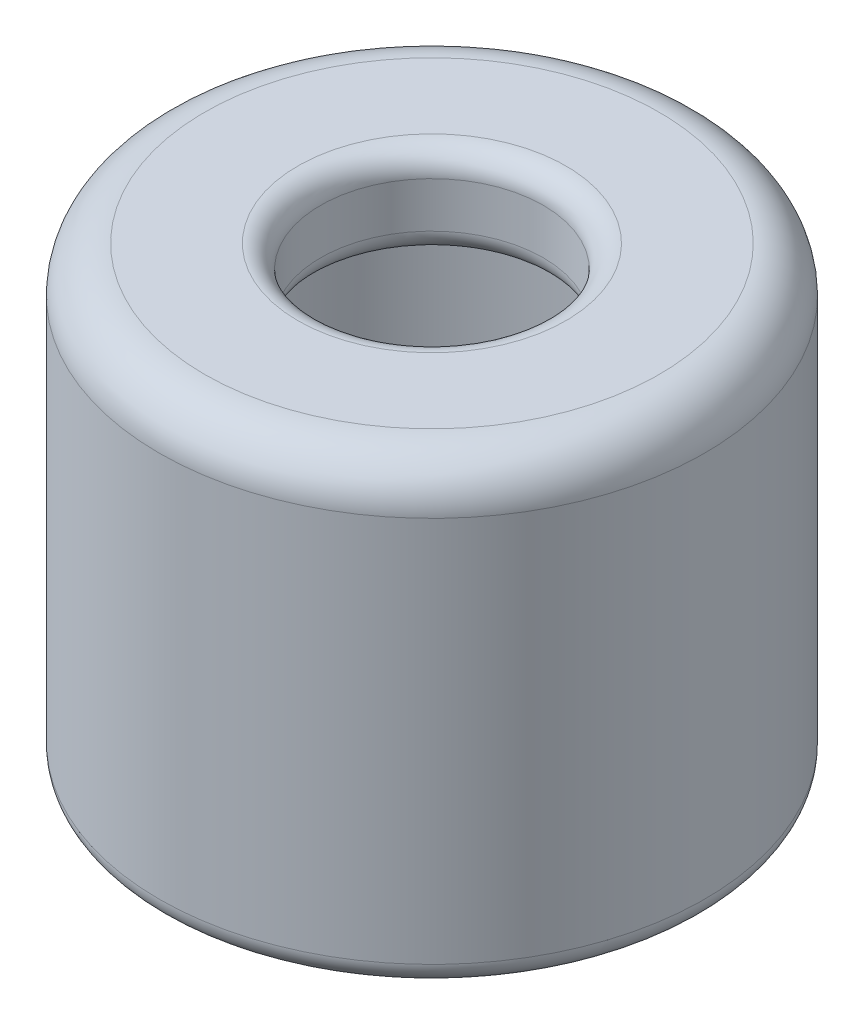
ISO-10303-21;
HEADER;
FILE_DESCRIPTION(('STEP AP214'),'2;1');
FILE_NAME('part.step','',(''),(''),'','','');
FILE_SCHEMA(('AUTOMOTIVE_DESIGN { 1 0 10303 214 1 1 1 1 }'));
ENDSEC;
DATA;
#1=APPLICATION_CONTEXT('core data for automotive mechanical design processes');
#2=APPLICATION_PROTOCOL_DEFINITION('international standard','automotive_design',2000,#1);
#3=PRODUCT_CONTEXT('',#1,'mechanical');
#4=PRODUCT('Part','Part','',(#3));
#5=PRODUCT_RELATED_PRODUCT_CATEGORY('part','',(#4));
#6=PRODUCT_DEFINITION_FORMATION('','',#4);
#7=PRODUCT_DEFINITION_CONTEXT('part definition',#1,'design');
#8=PRODUCT_DEFINITION('design','',#6,#7);
#9=PRODUCT_DEFINITION_SHAPE('','',#8);
#10=(LENGTH_UNIT() NAMED_UNIT(*) SI_UNIT(.MILLI.,.METRE.));
#11=(NAMED_UNIT(*) PLANE_ANGLE_UNIT() SI_UNIT($,.RADIAN.));
#12=(NAMED_UNIT(*) SI_UNIT($,.STERADIAN.) SOLID_ANGLE_UNIT());
#13=UNCERTAINTY_MEASURE_WITH_UNIT(LENGTH_MEASURE(1.E-05),#10,'distance_accuracy_value','');
#14=(GEOMETRIC_REPRESENTATION_CONTEXT(3) GLOBAL_UNCERTAINTY_ASSIGNED_CONTEXT((#13)) GLOBAL_UNIT_ASSIGNED_CONTEXT((#10,
#11,#12)) REPRESENTATION_CONTEXT('',''));
#15=CARTESIAN_POINT('',(0.,0.,0.));
#16=DIRECTION('',(0.,0.,1.));
#17=DIRECTION('',(1.,0.,0.));
#18=AXIS2_PLACEMENT_3D('',#15,#16,#17);
#19=CARTESIAN_POINT('',(0.,10.,0.));
#20=DIRECTION('',(0.,-1.,0.));
#21=DIRECTION('',(0.,0.,-1.));
#22=AXIS2_PLACEMENT_3D('',#19,#20,#21);
#23=CYLINDRICAL_SURFACE('',#22,2.45);
#24=CARTESIAN_POINT('',(0.,8.5,0.));
#25=DIRECTION('',(0.,-1.,0.));
#26=DIRECTION('',(0.,0.,-1.));
#27=AXIS2_PLACEMENT_3D('',#24,#25,#26);
#28=CIRCLE('',#27,2.45);
#29=CARTESIAN_POINT('',(0.,8.5,-2.45));
#30=VERTEX_POINT('',#29);
#31=EDGE_CURVE('E50',#30,#30,#28,.T.);
#32=ORIENTED_EDGE('',*,*,#31,.T.);
#33=EDGE_LOOP('',(#32));
#34=FACE_BOUND('',#33,.T.);
#35=CARTESIAN_POINT('',(0.,9.5,0.));
#36=DIRECTION('',(0.,1.,0.));
#37=DIRECTION('',(0.,0.,1.));
#38=AXIS2_PLACEMENT_3D('',#35,#36,#37);
#39=CIRCLE('',#38,2.45);
#40=CARTESIAN_POINT('',(0.,9.5,2.45));
#41=VERTEX_POINT('',#40);
#42=EDGE_CURVE('E55',#41,#41,#39,.T.);
#43=ORIENTED_EDGE('',*,*,#42,.T.);
#44=EDGE_LOOP('',(#43));
#45=FACE_BOUND('',#44,.T.);
#46=ADVANCED_FACE('F35',(#34,#45),#23,.F.);
#47=CARTESIAN_POINT('',(0.,10.,0.));
#48=DIRECTION('',(0.,1.,0.));
#49=DIRECTION('',(0.,0.,1.));
#50=AXIS2_PLACEMENT_3D('',#47,#48,#49);
#51=PLANE('',#50);
#52=CARTESIAN_POINT('',(0.,10.,0.));
#53=DIRECTION('',(0.,1.,0.));
#54=DIRECTION('',(0.,0.,1.));
#55=AXIS2_PLACEMENT_3D('',#52,#53,#54);
#56=CIRCLE('',#55,2.95);
#57=CARTESIAN_POINT('',(0.,10.,2.95));
#58=VERTEX_POINT('',#57);
#59=EDGE_CURVE('E10',#58,#58,#56,.F.);
#60=ORIENTED_EDGE('',*,*,#59,.T.);
#61=EDGE_LOOP('',(#60));
#62=FACE_BOUND('',#61,.T.);
#63=CARTESIAN_POINT('',(0.,10.,0.));
#64=DIRECTION('',(0.,1.,0.));
#65=DIRECTION('',(0.,0.,1.));
#66=AXIS2_PLACEMENT_3D('',#63,#64,#65);
#67=CIRCLE('',#66,5.);
#68=CARTESIAN_POINT('',(0.,10.,5.));
#69=VERTEX_POINT('',#68);
#70=EDGE_CURVE('E76',#69,#69,#67,.T.);
#71=ORIENTED_EDGE('',*,*,#70,.T.);
#72=EDGE_LOOP('',(#71));
#73=FACE_BOUND('',#72,.T.);
#74=ADVANCED_FACE('F80',(#62,#73),#51,.T.);
#75=CARTESIAN_POINT('',(0.,0.,0.));
#76=DIRECTION('',(0.,1.,0.));
#77=DIRECTION('',(0.,0.,1.));
#78=AXIS2_PLACEMENT_3D('',#75,#76,#77);
#79=PLANE('',#78);
#80=CARTESIAN_POINT('',(0.,0.,0.));
#81=DIRECTION('',(0.,1.,0.));
#82=DIRECTION('',(0.,0.,1.));
#83=AXIS2_PLACEMENT_3D('',#80,#81,#82);
#84=CIRCLE('',#83,5.5);
#85=CARTESIAN_POINT('',(0.,0.,5.5));
#86=VERTEX_POINT('',#85);
#87=EDGE_CURVE('E64',#86,#86,#84,.F.);
#88=ORIENTED_EDGE('',*,*,#87,.T.);
#89=EDGE_LOOP('',(#88));
#90=FACE_BOUND('',#89,.T.);
#91=CARTESIAN_POINT('',(0.,0.,0.));
#92=DIRECTION('',(0.,1.,0.));
#93=DIRECTION('',(0.,0.,1.));
#94=AXIS2_PLACEMENT_3D('',#91,#92,#93);
#95=CIRCLE('',#94,5.);
#96=CARTESIAN_POINT('',(0.,0.,5.));
#97=VERTEX_POINT('',#96);
#98=EDGE_CURVE('E67',#97,#97,#95,.T.);
#99=ORIENTED_EDGE('',*,*,#98,.T.);
#100=EDGE_LOOP('',(#99));
#101=FACE_BOUND('',#100,.T.);
#102=ADVANCED_FACE('F105',(#90,#101),#79,.F.);
#103=CARTESIAN_POINT('',(0.,10.,0.));
#104=DIRECTION('',(0.,-1.,0.));
#105=DIRECTION('',(0.,0.,-1.));
#106=AXIS2_PLACEMENT_3D('',#103,#104,#105);
#107=CYLINDRICAL_SURFACE('',#106,6.);
#108=CARTESIAN_POINT('',(0.,0.5,0.));
#109=DIRECTION('',(0.,1.,0.));
#110=DIRECTION('',(0.,0.,1.));
#111=AXIS2_PLACEMENT_3D('',#108,#109,#110);
#112=CIRCLE('',#111,6.);
#113=CARTESIAN_POINT('',(0.,0.5,6.));
#114=VERTEX_POINT('',#113);
#115=EDGE_CURVE('E70',#114,#114,#112,.T.);
#116=ORIENTED_EDGE('',*,*,#115,.T.);
#117=EDGE_LOOP('',(#116));
#118=FACE_BOUND('',#117,.T.);
#119=CARTESIAN_POINT('',(0.,9.,0.));
#120=DIRECTION('',(0.,1.,0.));
#121=DIRECTION('',(0.,0.,1.));
#122=AXIS2_PLACEMENT_3D('',#119,#120,#121);
#123=CIRCLE('',#122,6.);
#124=CARTESIAN_POINT('',(0.,9.,6.));
#125=VERTEX_POINT('',#124);
#126=EDGE_CURVE('E73',#125,#125,#123,.F.);
#127=ORIENTED_EDGE('',*,*,#126,.T.);
#128=EDGE_LOOP('',(#127));
#129=FACE_BOUND('',#128,.T.);
#130=ADVANCED_FACE('F111',(#118,#129),#107,.T.);
#131=CARTESIAN_POINT('',(0.,8.,0.));
#132=DIRECTION('',(0.,-1.,0.));
#133=DIRECTION('',(0.,0.,-1.));
#134=AXIS2_PLACEMENT_3D('',#131,#132,#133);
#135=CYLINDRICAL_SURFACE('',#134,4.5);
#136=CARTESIAN_POINT('',(0.,0.5,0.));
#137=DIRECTION('',(0.,1.,0.));
#138=DIRECTION('',(0.,0.,1.));
#139=AXIS2_PLACEMENT_3D('',#136,#137,#138);
#140=CIRCLE('',#139,4.5);
#141=CARTESIAN_POINT('',(0.,0.5,4.5));
#142=VERTEX_POINT('',#141);
#143=EDGE_CURVE('E58',#142,#142,#140,.F.);
#144=ORIENTED_EDGE('',*,*,#143,.T.);
#145=EDGE_LOOP('',(#144));
#146=FACE_BOUND('',#145,.T.);
#147=CARTESIAN_POINT('',(0.,7.5,0.));
#148=DIRECTION('',(0.,-1.,0.));
#149=DIRECTION('',(0.,0.,-1.));
#150=AXIS2_PLACEMENT_3D('',#147,#148,#149);
#151=CIRCLE('',#150,4.5);
#152=CARTESIAN_POINT('',(0.,7.5,-4.5));
#153=VERTEX_POINT('',#152);
#154=EDGE_CURVE('E61',#153,#153,#151,.F.);
#155=ORIENTED_EDGE('',*,*,#154,.T.);
#156=EDGE_LOOP('',(#155));
#157=FACE_BOUND('',#156,.T.);
#158=ADVANCED_FACE('F95',(#146,#157),#135,.F.);
#159=CARTESIAN_POINT('',(0.,8.,0.));
#160=DIRECTION('',(0.,-1.,0.));
#161=DIRECTION('',(0.,0.,-1.));
#162=AXIS2_PLACEMENT_3D('',#159,#160,#161);
#163=PLANE('',#162);
#164=CARTESIAN_POINT('',(0.,8.,0.));
#165=DIRECTION('',(0.,-1.,0.));
#166=DIRECTION('',(0.,0.,-1.));
#167=AXIS2_PLACEMENT_3D('',#164,#165,#166);
#168=CIRCLE('',#167,2.95);
#169=CARTESIAN_POINT('',(0.,8.,-2.95));
#170=VERTEX_POINT('',#169);
#171=EDGE_CURVE('E42',#170,#170,#168,.F.);
#172=ORIENTED_EDGE('',*,*,#171,.T.);
#173=EDGE_LOOP('',(#172));
#174=FACE_BOUND('',#173,.T.);
#175=CARTESIAN_POINT('',(0.,8.,0.));
#176=DIRECTION('',(0.,-1.,0.));
#177=DIRECTION('',(0.,0.,-1.));
#178=AXIS2_PLACEMENT_3D('',#175,#176,#177);
#179=CIRCLE('',#178,4.);
#180=CARTESIAN_POINT('',(0.,8.,-4.));
#181=VERTEX_POINT('',#180);
#182=EDGE_CURVE('E46',#181,#181,#179,.T.);
#183=ORIENTED_EDGE('',*,*,#182,.T.);
#184=EDGE_LOOP('',(#183));
#185=FACE_BOUND('',#184,.T.);
#186=ADVANCED_FACE('F85',(#174,#185),#163,.T.);
#187=CARTESIAN_POINT('',(0.,9.,0.));
#188=DIRECTION('',(0.,1.,0.));
#189=DIRECTION('',(0.,0.,1.));
#190=AXIS2_PLACEMENT_3D('',#187,#188,#189);
#191=TOROIDAL_SURFACE('',#190,5.,1.);
#192=ORIENTED_EDGE('',*,*,#126,.F.);
#193=EDGE_LOOP('',(#192));
#194=FACE_BOUND('',#193,.T.);
#195=ORIENTED_EDGE('',*,*,#70,.F.);
#196=EDGE_LOOP('',(#195));
#197=FACE_BOUND('',#196,.T.);
#198=ADVANCED_FACE('F82',(#194,#197),#191,.T.);
#199=CARTESIAN_POINT('',(0.,0.5,0.));
#200=DIRECTION('',(0.,1.,0.));
#201=DIRECTION('',(0.,0.,1.));
#202=AXIS2_PLACEMENT_3D('',#199,#200,#201);
#203=TOROIDAL_SURFACE('',#202,5.5,0.5);
#204=ORIENTED_EDGE('',*,*,#87,.F.);
#205=EDGE_LOOP('',(#204));
#206=FACE_BOUND('',#205,.T.);
#207=ORIENTED_EDGE('',*,*,#115,.F.);
#208=EDGE_LOOP('',(#207));
#209=FACE_BOUND('',#208,.T.);
#210=ADVANCED_FACE('F84',(#206,#209),#203,.T.);
#211=CARTESIAN_POINT('',(0.,0.5,0.));
#212=DIRECTION('',(0.,1.,0.));
#213=DIRECTION('',(0.,0.,1.));
#214=AXIS2_PLACEMENT_3D('',#211,#212,#213);
#215=TOROIDAL_SURFACE('',#214,5.,0.5);
#216=ORIENTED_EDGE('',*,*,#98,.F.);
#217=EDGE_LOOP('',(#216));
#218=FACE_BOUND('',#217,.T.);
#219=ORIENTED_EDGE('',*,*,#143,.F.);
#220=EDGE_LOOP('',(#219));
#221=FACE_BOUND('',#220,.T.);
#222=ADVANCED_FACE('F92',(#218,#221),#215,.T.);
#223=CARTESIAN_POINT('',(0.,8.5,0.));
#224=DIRECTION('',(0.,-1.,0.));
#225=DIRECTION('',(0.,0.,-1.));
#226=AXIS2_PLACEMENT_3D('',#223,#224,#225);
#227=TOROIDAL_SURFACE('',#226,2.95,0.5);
#228=ORIENTED_EDGE('',*,*,#171,.F.);
#229=EDGE_LOOP('',(#228));
#230=FACE_BOUND('',#229,.T.);
#231=ORIENTED_EDGE('',*,*,#31,.F.);
#232=EDGE_LOOP('',(#231));
#233=FACE_BOUND('',#232,.T.);
#234=ADVANCED_FACE('F131',(#230,#233),#227,.T.);
#235=CARTESIAN_POINT('',(0.,7.5,0.));
#236=DIRECTION('',(0.,-1.,0.));
#237=DIRECTION('',(0.,0.,-1.));
#238=AXIS2_PLACEMENT_3D('',#235,#236,#237);
#239=TOROIDAL_SURFACE('',#238,4.,0.5);
#240=ORIENTED_EDGE('',*,*,#154,.F.);
#241=EDGE_LOOP('',(#240));
#242=FACE_BOUND('',#241,.T.);
#243=ORIENTED_EDGE('',*,*,#182,.F.);
#244=EDGE_LOOP('',(#243));
#245=FACE_BOUND('',#244,.T.);
#246=ADVANCED_FACE('F128',(#242,#245),#239,.F.);
#247=CARTESIAN_POINT('',(0.,9.5,0.));
#248=DIRECTION('',(0.,1.,0.));
#249=DIRECTION('',(0.,0.,1.));
#250=AXIS2_PLACEMENT_3D('',#247,#248,#249);
#251=TOROIDAL_SURFACE('',#250,2.95,0.5);
#252=ORIENTED_EDGE('',*,*,#59,.F.);
#253=EDGE_LOOP('',(#252));
#254=FACE_BOUND('',#253,.T.);
#255=ORIENTED_EDGE('',*,*,#42,.F.);
#256=EDGE_LOOP('',(#255));
#257=FACE_BOUND('',#256,.T.);
#258=ADVANCED_FACE('F37',(#254,#257),#251,.T.);
#259=CLOSED_SHELL('',(#46,#74,#102,#130,#158,#186,#198,#210,#222,#234,#246,#258));
#260=MANIFOLD_SOLID_BREP('B2',#259);
#261=ADVANCED_BREP_SHAPE_REPRESENTATION('',(#18,#260),#14);
#262=SHAPE_DEFINITION_REPRESENTATION(#9,#261);
ENDSEC;
END-ISO-10303-21;
